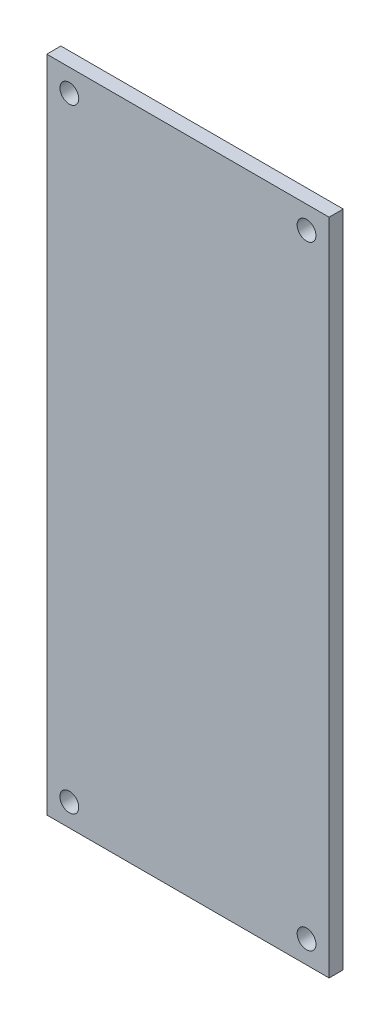
ISO-10303-21;
HEADER;
FILE_DESCRIPTION(('STEP AP214'),'2;1');
FILE_NAME('part.step','',(''),(''),'','','');
FILE_SCHEMA(('AUTOMOTIVE_DESIGN { 1 0 10303 214 1 1 1 1 }'));
ENDSEC;
DATA;
#1=APPLICATION_CONTEXT('core data for automotive mechanical design processes');
#2=APPLICATION_PROTOCOL_DEFINITION('international standard','automotive_design',2000,#1);
#3=PRODUCT_CONTEXT('',#1,'mechanical');
#4=PRODUCT('Part','Part','',(#3));
#5=PRODUCT_RELATED_PRODUCT_CATEGORY('part','',(#4));
#6=PRODUCT_DEFINITION_FORMATION('','',#4);
#7=PRODUCT_DEFINITION_CONTEXT('part definition',#1,'design');
#8=PRODUCT_DEFINITION('design','',#6,#7);
#9=PRODUCT_DEFINITION_SHAPE('','',#8);
#10=(LENGTH_UNIT() NAMED_UNIT(*) SI_UNIT(.MILLI.,.METRE.));
#11=(NAMED_UNIT(*) PLANE_ANGLE_UNIT() SI_UNIT($,.RADIAN.));
#12=(NAMED_UNIT(*) SI_UNIT($,.STERADIAN.) SOLID_ANGLE_UNIT());
#13=UNCERTAINTY_MEASURE_WITH_UNIT(LENGTH_MEASURE(1.E-05),#10,'distance_accuracy_value','');
#14=(GEOMETRIC_REPRESENTATION_CONTEXT(3) GLOBAL_UNCERTAINTY_ASSIGNED_CONTEXT((#13)) GLOBAL_UNIT_ASSIGNED_CONTEXT((#10,
#11,#12)) REPRESENTATION_CONTEXT('',''));
#15=CARTESIAN_POINT('',(0.,0.,0.));
#16=DIRECTION('',(0.,0.,1.));
#17=DIRECTION('',(1.,0.,0.));
#18=AXIS2_PLACEMENT_3D('',#15,#16,#17);
#19=CARTESIAN_POINT('',(0.,0.,1.5));
#20=DIRECTION('',(0.,0.,-1.));
#21=DIRECTION('',(-1.,0.,0.));
#22=AXIS2_PLACEMENT_3D('',#19,#20,#21);
#23=PLANE('',#22);
#24=DIRECTION('',(0.,-1.,0.));
#25=VECTOR('',#24,1.);
#26=CARTESIAN_POINT('',(-15.,-35.,1.5));
#27=LINE('',#26,#25);
#28=CARTESIAN_POINT('',(-15.,35.,1.5));
#29=VERTEX_POINT('',#28);
#30=CARTESIAN_POINT('',(-15.,-35.,1.5));
#31=VERTEX_POINT('',#30);
#32=EDGE_CURVE('E90',#29,#31,#27,.T.);
#33=ORIENTED_EDGE('',*,*,#32,.T.);
#34=DIRECTION('',(1.,0.,0.));
#35=VECTOR('',#34,1.);
#36=CARTESIAN_POINT('',(-15.,-35.,1.5));
#37=LINE('',#36,#35);
#38=CARTESIAN_POINT('',(15.,-35.,1.5));
#39=VERTEX_POINT('',#38);
#40=EDGE_CURVE('E85',#31,#39,#37,.T.);
#41=ORIENTED_EDGE('',*,*,#40,.T.);
#42=DIRECTION('',(0.,1.,0.));
#43=VECTOR('',#42,1.);
#44=CARTESIAN_POINT('',(15.,-35.,1.5));
#45=LINE('',#44,#43);
#46=CARTESIAN_POINT('',(15.,35.,1.5));
#47=VERTEX_POINT('',#46);
#48=EDGE_CURVE('E88',#39,#47,#45,.T.);
#49=ORIENTED_EDGE('',*,*,#48,.T.);
#50=DIRECTION('',(-1.,0.,0.));
#51=VECTOR('',#50,1.);
#52=CARTESIAN_POINT('',(-15.,35.,1.5));
#53=LINE('',#52,#51);
#54=EDGE_CURVE('E55',#47,#29,#53,.T.);
#55=ORIENTED_EDGE('',*,*,#54,.T.);
#56=EDGE_LOOP('',(#33,#41,#49,#55));
#57=FACE_BOUND('',#56,.T.);
#58=CARTESIAN_POINT('',(-12.6,32.6,1.5));
#59=DIRECTION('',(0.,0.,1.));
#60=DIRECTION('',(1.,0.,0.));
#61=AXIS2_PLACEMENT_3D('',#58,#59,#60);
#62=CIRCLE('',#61,1.);
#63=CARTESIAN_POINT('',(-11.6,32.6,1.5));
#64=VERTEX_POINT('',#63);
#65=EDGE_CURVE('E108',#64,#64,#62,.T.);
#66=ORIENTED_EDGE('',*,*,#65,.F.);
#67=EDGE_LOOP('',(#66));
#68=FACE_BOUND('',#67,.T.);
#69=CARTESIAN_POINT('',(12.6,32.6,1.5));
#70=DIRECTION('',(0.,0.,1.));
#71=DIRECTION('',(-1.,0.,0.));
#72=AXIS2_PLACEMENT_3D('',#69,#70,#71);
#73=CIRCLE('',#72,1.);
#74=CARTESIAN_POINT('',(11.6,32.6,1.5));
#75=VERTEX_POINT('',#74);
#76=EDGE_CURVE('E123',#75,#75,#73,.T.);
#77=ORIENTED_EDGE('',*,*,#76,.F.);
#78=EDGE_LOOP('',(#77));
#79=FACE_BOUND('',#78,.T.);
#80=CARTESIAN_POINT('',(12.6,-32.6,1.5));
#81=DIRECTION('',(0.,0.,1.));
#82=DIRECTION('',(1.,0.,0.));
#83=AXIS2_PLACEMENT_3D('',#80,#81,#82);
#84=CIRCLE('',#83,1.);
#85=CARTESIAN_POINT('',(13.6,-32.6,1.5));
#86=VERTEX_POINT('',#85);
#87=EDGE_CURVE('E129',#86,#86,#84,.T.);
#88=ORIENTED_EDGE('',*,*,#87,.F.);
#89=EDGE_LOOP('',(#88));
#90=FACE_BOUND('',#89,.T.);
#91=CARTESIAN_POINT('',(-12.6,-32.6,1.5));
#92=DIRECTION('',(0.,0.,1.));
#93=DIRECTION('',(-1.,0.,0.));
#94=AXIS2_PLACEMENT_3D('',#91,#92,#93);
#95=CIRCLE('',#94,1.);
#96=CARTESIAN_POINT('',(-13.6,-32.6,1.5));
#97=VERTEX_POINT('',#96);
#98=EDGE_CURVE('E135',#97,#97,#95,.T.);
#99=ORIENTED_EDGE('',*,*,#98,.F.);
#100=EDGE_LOOP('',(#99));
#101=FACE_BOUND('',#100,.T.);
#102=ADVANCED_FACE('F38',(#57,#68,#79,#90,#101),#23,.F.);
#103=CARTESIAN_POINT('',(0.,0.,0.));
#104=DIRECTION('',(0.,0.,-1.));
#105=DIRECTION('',(-1.,0.,0.));
#106=AXIS2_PLACEMENT_3D('',#103,#104,#105);
#107=PLANE('',#106);
#108=CARTESIAN_POINT('',(12.6,-32.6,0.));
#109=DIRECTION('',(0.,0.,1.));
#110=DIRECTION('',(1.,0.,0.));
#111=AXIS2_PLACEMENT_3D('',#108,#109,#110);
#112=CIRCLE('',#111,1.);
#113=CARTESIAN_POINT('',(13.6,-32.6,0.));
#114=VERTEX_POINT('',#113);
#115=EDGE_CURVE('E132',#114,#114,#112,.T.);
#116=ORIENTED_EDGE('',*,*,#115,.T.);
#117=EDGE_LOOP('',(#116));
#118=FACE_BOUND('',#117,.T.);
#119=CARTESIAN_POINT('',(-12.6,32.6,0.));
#120=DIRECTION('',(0.,0.,1.));
#121=DIRECTION('',(1.,0.,0.));
#122=AXIS2_PLACEMENT_3D('',#119,#120,#121);
#123=CIRCLE('',#122,1.);
#124=CARTESIAN_POINT('',(-11.6,32.6,0.));
#125=VERTEX_POINT('',#124);
#126=EDGE_CURVE('E120',#125,#125,#123,.T.);
#127=ORIENTED_EDGE('',*,*,#126,.T.);
#128=EDGE_LOOP('',(#127));
#129=FACE_BOUND('',#128,.T.);
#130=DIRECTION('',(0.,-1.,0.));
#131=VECTOR('',#130,1.);
#132=CARTESIAN_POINT('',(-15.,-35.,0.));
#133=LINE('',#132,#131);
#134=CARTESIAN_POINT('',(-15.,35.,0.));
#135=VERTEX_POINT('',#134);
#136=CARTESIAN_POINT('',(-15.,-35.,0.));
#137=VERTEX_POINT('',#136);
#138=EDGE_CURVE('E105',#135,#137,#133,.T.);
#139=ORIENTED_EDGE('',*,*,#138,.F.);
#140=DIRECTION('',(-1.,0.,0.));
#141=VECTOR('',#140,1.);
#142=CARTESIAN_POINT('',(-15.,35.,0.));
#143=LINE('',#142,#141);
#144=CARTESIAN_POINT('',(15.,35.,0.));
#145=VERTEX_POINT('',#144);
#146=EDGE_CURVE('E78',#145,#135,#143,.T.);
#147=ORIENTED_EDGE('',*,*,#146,.F.);
#148=DIRECTION('',(0.,1.,0.));
#149=VECTOR('',#148,1.);
#150=CARTESIAN_POINT('',(15.,-35.,0.));
#151=LINE('',#150,#149);
#152=CARTESIAN_POINT('',(15.,-35.,0.));
#153=VERTEX_POINT('',#152);
#154=EDGE_CURVE('E72',#153,#145,#151,.T.);
#155=ORIENTED_EDGE('',*,*,#154,.F.);
#156=DIRECTION('',(1.,0.,0.));
#157=VECTOR('',#156,1.);
#158=CARTESIAN_POINT('',(-15.,-35.,0.));
#159=LINE('',#158,#157);
#160=EDGE_CURVE('E94',#137,#153,#159,.T.);
#161=ORIENTED_EDGE('',*,*,#160,.F.);
#162=EDGE_LOOP('',(#139,#147,#155,#161));
#163=FACE_BOUND('',#162,.T.);
#164=CARTESIAN_POINT('',(12.6,32.6,0.));
#165=DIRECTION('',(0.,0.,1.));
#166=DIRECTION('',(-1.,0.,0.));
#167=AXIS2_PLACEMENT_3D('',#164,#165,#166);
#168=CIRCLE('',#167,1.);
#169=CARTESIAN_POINT('',(11.6,32.6,0.));
#170=VERTEX_POINT('',#169);
#171=EDGE_CURVE('E126',#170,#170,#168,.T.);
#172=ORIENTED_EDGE('',*,*,#171,.T.);
#173=EDGE_LOOP('',(#172));
#174=FACE_BOUND('',#173,.T.);
#175=CARTESIAN_POINT('',(-12.6,-32.6,0.));
#176=DIRECTION('',(0.,0.,1.));
#177=DIRECTION('',(-1.,0.,0.));
#178=AXIS2_PLACEMENT_3D('',#175,#176,#177);
#179=CIRCLE('',#178,1.);
#180=CARTESIAN_POINT('',(-13.6,-32.6,0.));
#181=VERTEX_POINT('',#180);
#182=EDGE_CURVE('E138',#181,#181,#179,.T.);
#183=ORIENTED_EDGE('',*,*,#182,.T.);
#184=EDGE_LOOP('',(#183));
#185=FACE_BOUND('',#184,.T.);
#186=ADVANCED_FACE('F116',(#118,#129,#163,#174,#185),#107,.T.);
#187=CARTESIAN_POINT('',(-15.,-35.,1.5));
#188=DIRECTION('',(1.,0.,0.));
#189=DIRECTION('',(0.,0.,-1.));
#190=AXIS2_PLACEMENT_3D('',#187,#188,#189);
#191=PLANE('',#190);
#192=ORIENTED_EDGE('',*,*,#138,.T.);
#193=DIRECTION('',(0.,0.,-1.));
#194=VECTOR('',#193,1.);
#195=CARTESIAN_POINT('',(-15.,-35.,1.5));
#196=LINE('',#195,#194);
#197=EDGE_CURVE('E11',#31,#137,#196,.T.);
#198=ORIENTED_EDGE('',*,*,#197,.F.);
#199=ORIENTED_EDGE('',*,*,#32,.F.);
#200=DIRECTION('',(0.,0.,-1.));
#201=VECTOR('',#200,1.);
#202=CARTESIAN_POINT('',(-15.,35.,1.5));
#203=LINE('',#202,#201);
#204=EDGE_CURVE('E101',#29,#135,#203,.T.);
#205=ORIENTED_EDGE('',*,*,#204,.T.);
#206=EDGE_LOOP('',(#192,#198,#199,#205));
#207=FACE_BOUND('',#206,.T.);
#208=ADVANCED_FACE('F40',(#207),#191,.F.);
#209=CARTESIAN_POINT('',(-15.,-35.,1.5));
#210=DIRECTION('',(0.,1.,0.));
#211=DIRECTION('',(0.,0.,1.));
#212=AXIS2_PLACEMENT_3D('',#209,#210,#211);
#213=PLANE('',#212);
#214=ORIENTED_EDGE('',*,*,#160,.T.);
#215=DIRECTION('',(0.,0.,-1.));
#216=VECTOR('',#215,1.);
#217=CARTESIAN_POINT('',(15.,-35.,1.5));
#218=LINE('',#217,#216);
#219=EDGE_CURVE('E47',#39,#153,#218,.T.);
#220=ORIENTED_EDGE('',*,*,#219,.F.);
#221=ORIENTED_EDGE('',*,*,#40,.F.);
#222=ORIENTED_EDGE('',*,*,#197,.T.);
#223=EDGE_LOOP('',(#214,#220,#221,#222));
#224=FACE_BOUND('',#223,.T.);
#225=ADVANCED_FACE('F93',(#224),#213,.F.);
#226=CARTESIAN_POINT('',(15.,-35.,1.5));
#227=DIRECTION('',(-1.,0.,0.));
#228=DIRECTION('',(0.,0.,1.));
#229=AXIS2_PLACEMENT_3D('',#226,#227,#228);
#230=PLANE('',#229);
#231=ORIENTED_EDGE('',*,*,#154,.T.);
#232=DIRECTION('',(0.,0.,-1.));
#233=VECTOR('',#232,1.);
#234=CARTESIAN_POINT('',(15.,35.,1.5));
#235=LINE('',#234,#233);
#236=EDGE_CURVE('E95',#47,#145,#235,.T.);
#237=ORIENTED_EDGE('',*,*,#236,.F.);
#238=ORIENTED_EDGE('',*,*,#48,.F.);
#239=ORIENTED_EDGE('',*,*,#219,.T.);
#240=EDGE_LOOP('',(#231,#237,#238,#239));
#241=FACE_BOUND('',#240,.T.);
#242=ADVANCED_FACE('F96',(#241),#230,.F.);
#243=CARTESIAN_POINT('',(-15.,35.,1.5));
#244=DIRECTION('',(0.,-1.,0.));
#245=DIRECTION('',(0.,0.,-1.));
#246=AXIS2_PLACEMENT_3D('',#243,#244,#245);
#247=PLANE('',#246);
#248=ORIENTED_EDGE('',*,*,#146,.T.);
#249=ORIENTED_EDGE('',*,*,#204,.F.);
#250=ORIENTED_EDGE('',*,*,#54,.F.);
#251=ORIENTED_EDGE('',*,*,#236,.T.);
#252=EDGE_LOOP('',(#248,#249,#250,#251));
#253=FACE_BOUND('',#252,.T.);
#254=ADVANCED_FACE('F113',(#253),#247,.F.);
#255=CARTESIAN_POINT('',(-12.6,32.6,1.5));
#256=DIRECTION('',(0.,0.,-1.));
#257=DIRECTION('',(-1.,0.,0.));
#258=AXIS2_PLACEMENT_3D('',#255,#256,#257);
#259=CYLINDRICAL_SURFACE('',#258,1.);
#260=ORIENTED_EDGE('',*,*,#65,.T.);
#261=EDGE_LOOP('',(#260));
#262=FACE_BOUND('',#261,.T.);
#263=ORIENTED_EDGE('',*,*,#126,.F.);
#264=EDGE_LOOP('',(#263));
#265=FACE_BOUND('',#264,.T.);
#266=ADVANCED_FACE('F155',(#262,#265),#259,.F.);
#267=CARTESIAN_POINT('',(12.6,32.6,1.5));
#268=DIRECTION('',(0.,0.,-1.));
#269=DIRECTION('',(-1.,0.,0.));
#270=AXIS2_PLACEMENT_3D('',#267,#268,#269);
#271=CYLINDRICAL_SURFACE('',#270,1.);
#272=ORIENTED_EDGE('',*,*,#76,.T.);
#273=EDGE_LOOP('',(#272));
#274=FACE_BOUND('',#273,.T.);
#275=ORIENTED_EDGE('',*,*,#171,.F.);
#276=EDGE_LOOP('',(#275));
#277=FACE_BOUND('',#276,.T.);
#278=ADVANCED_FACE('F203',(#274,#277),#271,.F.);
#279=CARTESIAN_POINT('',(12.6,-32.6,1.5));
#280=DIRECTION('',(0.,0.,-1.));
#281=DIRECTION('',(-1.,0.,0.));
#282=AXIS2_PLACEMENT_3D('',#279,#280,#281);
#283=CYLINDRICAL_SURFACE('',#282,1.);
#284=ORIENTED_EDGE('',*,*,#87,.T.);
#285=EDGE_LOOP('',(#284));
#286=FACE_BOUND('',#285,.T.);
#287=ORIENTED_EDGE('',*,*,#115,.F.);
#288=EDGE_LOOP('',(#287));
#289=FACE_BOUND('',#288,.T.);
#290=ADVANCED_FACE('F211',(#286,#289),#283,.F.);
#291=CARTESIAN_POINT('',(-12.6,-32.6,1.5));
#292=DIRECTION('',(0.,0.,-1.));
#293=DIRECTION('',(-1.,0.,0.));
#294=AXIS2_PLACEMENT_3D('',#291,#292,#293);
#295=CYLINDRICAL_SURFACE('',#294,1.);
#296=ORIENTED_EDGE('',*,*,#98,.T.);
#297=EDGE_LOOP('',(#296));
#298=FACE_BOUND('',#297,.T.);
#299=ORIENTED_EDGE('',*,*,#182,.F.);
#300=EDGE_LOOP('',(#299));
#301=FACE_BOUND('',#300,.T.);
#302=ADVANCED_FACE('F144',(#298,#301),#295,.F.);
#303=CLOSED_SHELL('',(#102,#186,#208,#225,#242,#254,#266,#278,#290,#302));
#304=MANIFOLD_SOLID_BREP('B2',#303);
#305=ADVANCED_BREP_SHAPE_REPRESENTATION('',(#18,#304),#14);
#306=SHAPE_DEFINITION_REPRESENTATION(#9,#305);
ENDSEC;
END-ISO-10303-21;
